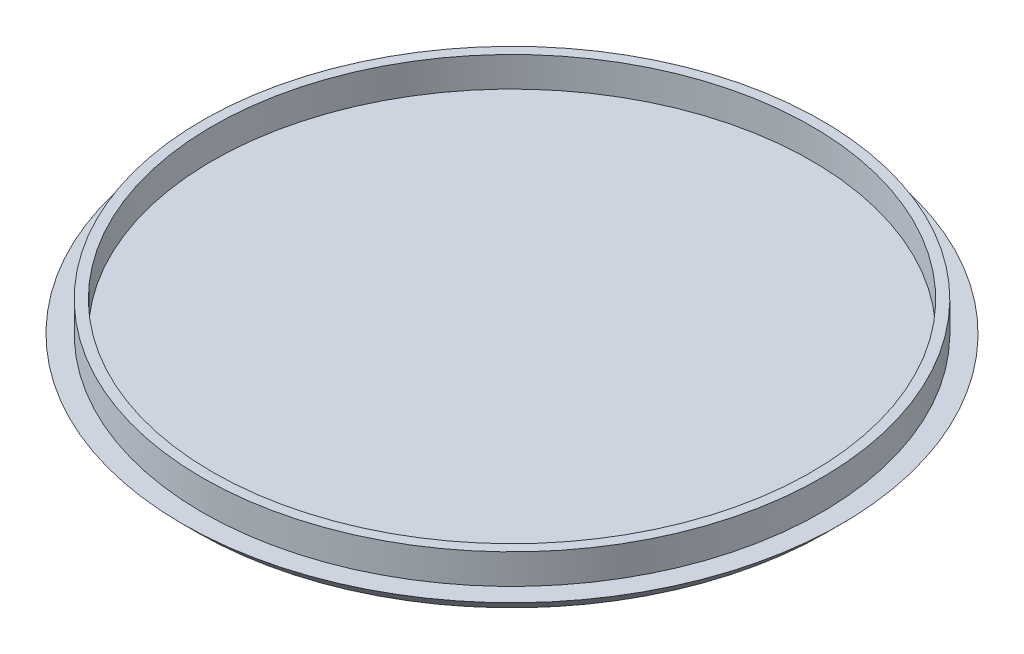
ISO-10303-21;
HEADER;
FILE_DESCRIPTION(('STEP AP214'),'2;1');
FILE_NAME('part.step','',(''),(''),'','','');
FILE_SCHEMA(('AUTOMOTIVE_DESIGN { 1 0 10303 214 1 1 1 1 }'));
ENDSEC;
DATA;
#1=APPLICATION_CONTEXT('core data for automotive mechanical design processes');
#2=APPLICATION_PROTOCOL_DEFINITION('international standard','automotive_design',2000,#1);
#3=PRODUCT_CONTEXT('',#1,'mechanical');
#4=PRODUCT('Part','Part','',(#3));
#5=PRODUCT_RELATED_PRODUCT_CATEGORY('part','',(#4));
#6=PRODUCT_DEFINITION_FORMATION('','',#4);
#7=PRODUCT_DEFINITION_CONTEXT('part definition',#1,'design');
#8=PRODUCT_DEFINITION('design','',#6,#7);
#9=PRODUCT_DEFINITION_SHAPE('','',#8);
#10=(LENGTH_UNIT() NAMED_UNIT(*) SI_UNIT(.MILLI.,.METRE.));
#11=(NAMED_UNIT(*) PLANE_ANGLE_UNIT() SI_UNIT($,.RADIAN.));
#12=(NAMED_UNIT(*) SI_UNIT($,.STERADIAN.) SOLID_ANGLE_UNIT());
#13=UNCERTAINTY_MEASURE_WITH_UNIT(LENGTH_MEASURE(1.E-05),#10,'distance_accuracy_value','');
#14=(GEOMETRIC_REPRESENTATION_CONTEXT(3) GLOBAL_UNCERTAINTY_ASSIGNED_CONTEXT((#13)) GLOBAL_UNIT_ASSIGNED_CONTEXT((#10,
#11,#12)) REPRESENTATION_CONTEXT('',''));
#15=CARTESIAN_POINT('',(0.,0.,0.));
#16=DIRECTION('',(0.,0.,1.));
#17=DIRECTION('',(1.,0.,0.));
#18=AXIS2_PLACEMENT_3D('',#15,#16,#17);
#19=CARTESIAN_POINT('',(0.,0.75,0.));
#20=DIRECTION('',(0.,1.,0.));
#21=DIRECTION('',(0.,0.,1.));
#22=AXIS2_PLACEMENT_3D('',#19,#20,#21);
#23=PLANE('',#22);
#24=CARTESIAN_POINT('',(0.,0.75,0.));
#25=DIRECTION('',(0.,1.,0.));
#26=DIRECTION('',(0.,0.,1.));
#27=AXIS2_PLACEMENT_3D('',#24,#25,#26);
#28=CIRCLE('',#27,15.5);
#29=CARTESIAN_POINT('',(0.,0.75,15.5));
#30=VERTEX_POINT('',#29);
#31=EDGE_CURVE('E65',#30,#30,#28,.T.);
#32=ORIENTED_EDGE('',*,*,#31,.F.);
#33=EDGE_LOOP('',(#32));
#34=FACE_BOUND('',#33,.T.);
#35=CARTESIAN_POINT('',(0.,0.75,0.));
#36=DIRECTION('',(0.,1.,0.));
#37=DIRECTION('',(0.,0.,1.));
#38=AXIS2_PLACEMENT_3D('',#35,#36,#37);
#39=CIRCLE('',#38,16.5);
#40=CARTESIAN_POINT('',(0.,0.75,16.5));
#41=VERTEX_POINT('',#40);
#42=EDGE_CURVE('E57',#41,#41,#39,.T.);
#43=ORIENTED_EDGE('',*,*,#42,.T.);
#44=EDGE_LOOP('',(#43));
#45=FACE_BOUND('',#44,.T.);
#46=ADVANCED_FACE('F43',(#34,#45),#23,.T.);
#47=CARTESIAN_POINT('',(0.,0.,0.));
#48=DIRECTION('',(0.,1.,0.));
#49=DIRECTION('',(0.,0.,1.));
#50=AXIS2_PLACEMENT_3D('',#47,#48,#49);
#51=PLANE('',#50);
#52=CARTESIAN_POINT('',(0.,0.,0.));
#53=DIRECTION('',(0.,1.,0.));
#54=DIRECTION('',(0.,0.,1.));
#55=AXIS2_PLACEMENT_3D('',#52,#53,#54);
#56=CIRCLE('',#55,15.75);
#57=CARTESIAN_POINT('',(0.,0.,15.75));
#58=VERTEX_POINT('',#57);
#59=EDGE_CURVE('E10',#58,#58,#56,.F.);
#60=ORIENTED_EDGE('',*,*,#59,.T.);
#61=EDGE_LOOP('',(#60));
#62=FACE_BOUND('',#61,.T.);
#63=ADVANCED_FACE('F82',(#62),#51,.F.);
#64=CARTESIAN_POINT('',(0.,2.25,0.));
#65=DIRECTION('',(0.,1.,0.));
#66=DIRECTION('',(0.,0.,1.));
#67=AXIS2_PLACEMENT_3D('',#64,#65,#66);
#68=PLANE('',#67);
#69=CARTESIAN_POINT('',(0.,2.25,0.));
#70=DIRECTION('',(0.,1.,0.));
#71=DIRECTION('',(0.,0.,1.));
#72=AXIS2_PLACEMENT_3D('',#69,#70,#71);
#73=CIRCLE('',#72,15.5);
#74=CARTESIAN_POINT('',(0.,2.25,15.5));
#75=VERTEX_POINT('',#74);
#76=EDGE_CURVE('E62',#75,#75,#73,.T.);
#77=ORIENTED_EDGE('',*,*,#76,.T.);
#78=EDGE_LOOP('',(#77));
#79=FACE_BOUND('',#78,.T.);
#80=CARTESIAN_POINT('',(0.,2.25,0.));
#81=DIRECTION('',(0.,1.,0.));
#82=DIRECTION('',(0.,0.,1.));
#83=AXIS2_PLACEMENT_3D('',#80,#81,#82);
#84=CIRCLE('',#83,15.);
#85=CARTESIAN_POINT('',(0.,2.25,15.));
#86=VERTEX_POINT('',#85);
#87=EDGE_CURVE('E69',#86,#86,#84,.T.);
#88=ORIENTED_EDGE('',*,*,#87,.F.);
#89=EDGE_LOOP('',(#88));
#90=FACE_BOUND('',#89,.T.);
#91=ADVANCED_FACE('F79',(#79,#90),#68,.T.);
#92=CARTESIAN_POINT('',(0.,2.25,0.));
#93=DIRECTION('',(0.,-1.,0.));
#94=DIRECTION('',(0.,0.,-1.));
#95=AXIS2_PLACEMENT_3D('',#92,#93,#94);
#96=CYLINDRICAL_SURFACE('',#95,15.5);
#97=ORIENTED_EDGE('',*,*,#76,.F.);
#98=EDGE_LOOP('',(#97));
#99=FACE_BOUND('',#98,.T.);
#100=ORIENTED_EDGE('',*,*,#31,.T.);
#101=EDGE_LOOP('',(#100));
#102=FACE_BOUND('',#101,.T.);
#103=ADVANCED_FACE('F81',(#99,#102),#96,.T.);
#104=CARTESIAN_POINT('',(0.,2.25,0.));
#105=DIRECTION('',(0.,-1.,0.));
#106=DIRECTION('',(0.,0.,-1.));
#107=AXIS2_PLACEMENT_3D('',#104,#105,#106);
#108=CYLINDRICAL_SURFACE('',#107,15.);
#109=ORIENTED_EDGE('',*,*,#87,.T.);
#110=EDGE_LOOP('',(#109));
#111=FACE_BOUND('',#110,.T.);
#112=CARTESIAN_POINT('',(0.,0.75,0.));
#113=DIRECTION('',(0.,1.,0.));
#114=DIRECTION('',(0.,0.,1.));
#115=AXIS2_PLACEMENT_3D('',#112,#113,#114);
#116=CIRCLE('',#115,15.);
#117=CARTESIAN_POINT('',(0.,0.75,15.));
#118=VERTEX_POINT('',#117);
#119=EDGE_CURVE('E52',#118,#118,#116,.F.);
#120=ORIENTED_EDGE('',*,*,#119,.T.);
#121=EDGE_LOOP('',(#120));
#122=FACE_BOUND('',#121,.T.);
#123=ADVANCED_FACE('F77',(#111,#122),#108,.F.);
#124=ORIENTED_EDGE('',*,*,#119,.F.);
#125=EDGE_LOOP('',(#124));
#126=FACE_BOUND('',#125,.T.);
#127=ADVANCED_FACE('F95',(#126),#23,.T.);
#128=CARTESIAN_POINT('',(0.,0.750000000000001,0.));
#129=DIRECTION('',(0.,1.,0.));
#130=DIRECTION('',(0.,0.,1.));
#131=AXIS2_PLACEMENT_3D('',#128,#129,#130);
#132=CONICAL_SURFACE('',#131,16.5,0.785398163397448);
#133=ORIENTED_EDGE('',*,*,#59,.F.);
#134=EDGE_LOOP('',(#133));
#135=FACE_BOUND('',#134,.T.);
#136=ORIENTED_EDGE('',*,*,#42,.F.);
#137=EDGE_LOOP('',(#136));
#138=FACE_BOUND('',#137,.T.);
#139=ADVANCED_FACE('F46',(#135,#138),#132,.T.);
#140=CLOSED_SHELL('',(#46,#63,#91,#103,#123,#127,#139));
#141=MANIFOLD_SOLID_BREP('B2',#140);
#142=ADVANCED_BREP_SHAPE_REPRESENTATION('',(#18,#141),#14);
#143=SHAPE_DEFINITION_REPRESENTATION(#9,#142);
ENDSEC;
END-ISO-10303-21;
